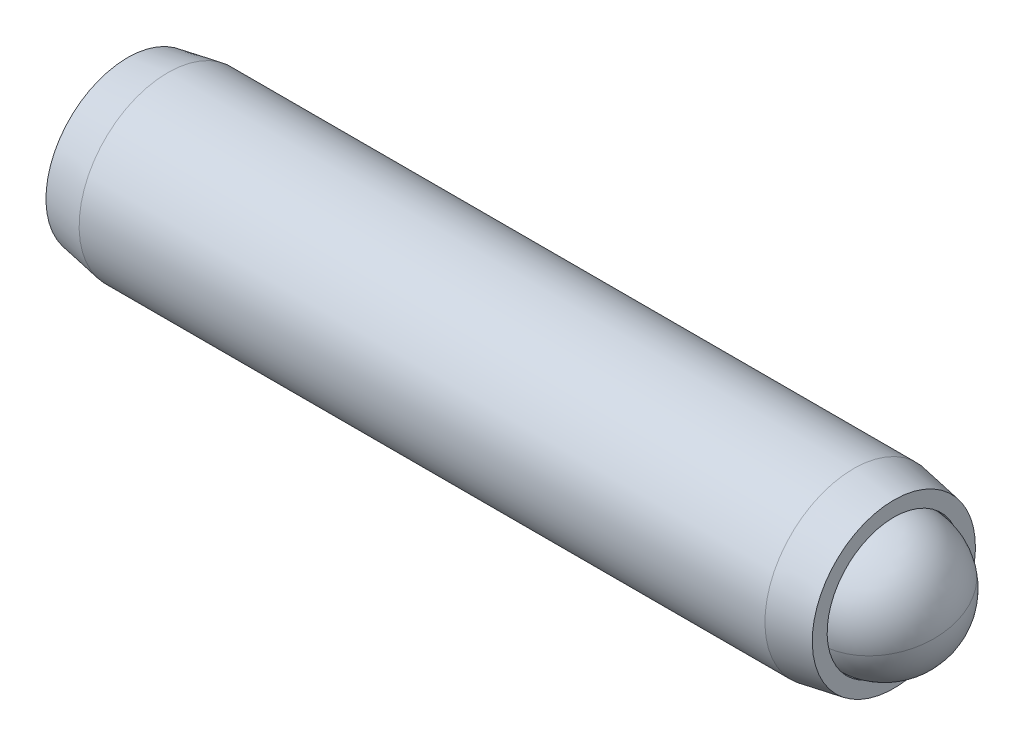
ISO-10303-21;
HEADER;
FILE_DESCRIPTION(('STEP AP214'),'2;1');
FILE_NAME('part.step','',(''),(''),'','','');
FILE_SCHEMA(('AUTOMOTIVE_DESIGN { 1 0 10303 214 1 1 1 1 }'));
ENDSEC;
DATA;
#1=APPLICATION_CONTEXT('core data for automotive mechanical design processes');
#2=APPLICATION_PROTOCOL_DEFINITION('international standard','automotive_design',2000,#1);
#3=PRODUCT_CONTEXT('',#1,'mechanical');
#4=PRODUCT('Part','Part','',(#3));
#5=PRODUCT_RELATED_PRODUCT_CATEGORY('part','',(#4));
#6=PRODUCT_DEFINITION_FORMATION('','',#4);
#7=PRODUCT_DEFINITION_CONTEXT('part definition',#1,'design');
#8=PRODUCT_DEFINITION('design','',#6,#7);
#9=PRODUCT_DEFINITION_SHAPE('','',#8);
#10=(LENGTH_UNIT() NAMED_UNIT(*) SI_UNIT(.MILLI.,.METRE.));
#11=(NAMED_UNIT(*) PLANE_ANGLE_UNIT() SI_UNIT($,.RADIAN.));
#12=(NAMED_UNIT(*) SI_UNIT($,.STERADIAN.) SOLID_ANGLE_UNIT());
#13=UNCERTAINTY_MEASURE_WITH_UNIT(LENGTH_MEASURE(1.E-05),#10,'distance_accuracy_value','');
#14=(GEOMETRIC_REPRESENTATION_CONTEXT(3) GLOBAL_UNCERTAINTY_ASSIGNED_CONTEXT((#13)) GLOBAL_UNIT_ASSIGNED_CONTEXT((#10,
#11,#12)) REPRESENTATION_CONTEXT('',''));
#15=CARTESIAN_POINT('',(0.,0.,0.));
#16=DIRECTION('',(0.,0.,1.));
#17=DIRECTION('',(1.,0.,0.));
#18=AXIS2_PLACEMENT_3D('',#15,#16,#17);
#19=CARTESIAN_POINT('',(-16.4333459470191,2.74204998828509,-0.965131231055238));
#20=DIRECTION('',(-1.,0.,0.));
#21=DIRECTION('',(0.,-1.,0.));
#22=AXIS2_PLACEMENT_3D('',#19,#20,#21);
#23=PLANE('',#22);
#24=DIRECTION('',(0.,0.866025403784439,-0.5));
#25=VECTOR('',#24,1.);
#26=CARTESIAN_POINT('',(-16.4333459470191,2.61504998828509,-2.33078112403965));
#27=LINE('',#26,#25);
#28=CARTESIAN_POINT('',(-16.4333459470191,1.49586248828509,-1.68461791964098));
#29=VERTEX_POINT('',#28);
#30=CARTESIAN_POINT('',(-16.4333459470191,2.74204998828509,-2.40410460822673));
#31=VERTEX_POINT('',#30);
#32=EDGE_CURVE('P0_E164',#29,#31,#27,.T.);
#33=ORIENTED_EDGE('',*,*,#32,.T.);
#34=DIRECTION('',(0.,0.866025403784439,0.5));
#35=VECTOR('',#34,1.);
#36=CARTESIAN_POINT('',(-16.4333459470191,3.86123748828509,-1.75794140382807));
#37=LINE('',#36,#35);
#38=CARTESIAN_POINT('',(-16.4333459470191,3.98823748828509,-1.68461791964098));
#39=VERTEX_POINT('',#38);
#40=EDGE_CURVE('P0_E166',#31,#39,#37,.T.);
#41=ORIENTED_EDGE('',*,*,#40,.T.);
#42=DIRECTION('',(0.,0.,1.));
#43=VECTOR('',#42,1.);
#44=CARTESIAN_POINT('',(-16.4333459470191,3.98823748828509,-0.392291510843657));
#45=LINE('',#44,#43);
#46=CARTESIAN_POINT('',(-16.4333459470191,3.98823748828509,-0.245644542469495));
#47=VERTEX_POINT('',#46);
#48=EDGE_CURVE('P0_E156',#39,#47,#45,.T.);
#49=ORIENTED_EDGE('',*,*,#48,.T.);
#50=DIRECTION('',(0.,-0.866025403784438,0.5));
#51=VECTOR('',#50,1.);
#52=CARTESIAN_POINT('',(-16.4333459470191,2.86904998828509,0.400518661929169));
#53=LINE('',#52,#51);
#54=CARTESIAN_POINT('',(-16.4333459470191,2.74204998828509,0.473842146116251));
#55=VERTEX_POINT('',#54);
#56=EDGE_CURVE('P0_E158',#47,#55,#53,.T.);
#57=ORIENTED_EDGE('',*,*,#56,.T.);
#58=DIRECTION('',(0.,-0.866025403784439,-0.5));
#59=VECTOR('',#58,1.);
#60=CARTESIAN_POINT('',(-16.4333459470191,1.62286248828509,-0.172321058282412));
#61=LINE('',#60,#59);
#62=CARTESIAN_POINT('',(-16.4333459470191,1.49586248828509,-0.245644542469493));
#63=VERTEX_POINT('',#62);
#64=EDGE_CURVE('P0_E160',#55,#63,#61,.T.);
#65=ORIENTED_EDGE('',*,*,#64,.T.);
#66=DIRECTION('',(0.,0.,-1.));
#67=VECTOR('',#66,1.);
#68=CARTESIAN_POINT('',(-16.4333459470191,1.49586248828509,-1.53797095126682));
#69=LINE('',#68,#67);
#70=EDGE_CURVE('P0_E162',#63,#29,#69,.T.);
#71=ORIENTED_EDGE('',*,*,#70,.T.);
#72=EDGE_LOOP('',(#33,#41,#49,#57,#65,#71));
#73=FACE_BOUND('',#72,.T.);
#74=CARTESIAN_POINT('',(-16.4333459470191,2.74204998828509,-0.965131231055238));
#75=DIRECTION('',(1.,0.,0.));
#76=DIRECTION('',(0.,1.,0.));
#77=AXIS2_PLACEMENT_3D('',#74,#75,#76);
#78=CIRCLE('',#77,2.921);
#79=CARTESIAN_POINT('',(-16.4333459470191,5.66304998828509,-0.965131231055238));
#80=VERTEX_POINT('',#79);
#81=EDGE_CURVE('P0_E150',#80,#80,#78,.T.);
#82=ORIENTED_EDGE('',*,*,#81,.F.);
#83=EDGE_LOOP('',(#82));
#84=FACE_BOUND('',#83,.T.);
#85=ADVANCED_FACE('P0_F17',(#73,#84),#23,.T.);
#86=CARTESIAN_POINT('',(-14.9928403648362,2.74204998828509,-0.965131231055238));
#87=DIRECTION('',(1.,0.,0.));
#88=DIRECTION('',(0.,1.,0.));
#89=AXIS2_PLACEMENT_3D('',#86,#87,#88);
#90=CONICAL_SURFACE('',#89,3.175,0.174532925199434);
#91=ORIENTED_EDGE('',*,*,#81,.T.);
#92=EDGE_LOOP('',(#91));
#93=FACE_BOUND('',#92,.T.);
#94=CARTESIAN_POINT('',(-14.9928403648362,2.74204998828509,-0.965131231055238));
#95=DIRECTION('',(1.,0.,0.));
#96=DIRECTION('',(0.,1.,0.));
#97=AXIS2_PLACEMENT_3D('',#94,#95,#96);
#98=CIRCLE('',#97,3.175);
#99=CARTESIAN_POINT('',(-14.9928403648362,5.91704998828509,-0.965131231055238));
#100=VERTEX_POINT('',#99);
#101=EDGE_CURVE('P0_E147',#100,#100,#98,.T.);
#102=ORIENTED_EDGE('',*,*,#101,.F.);
#103=EDGE_LOOP('',(#102));
#104=FACE_BOUND('',#103,.T.);
#105=ADVANCED_FACE('P0_F225',(#93,#104),#90,.T.);
#106=CARTESIAN_POINT('',(7.28180800757997,2.7420499882851,-0.965131231055238));
#107=DIRECTION('',(1.,0.,0.));
#108=DIRECTION('',(0.,1.,0.));
#109=AXIS2_PLACEMENT_3D('',#106,#107,#108);
#110=CYLINDRICAL_SURFACE('',#109,3.175);
#111=ORIENTED_EDGE('',*,*,#101,.T.);
#112=EDGE_LOOP('',(#111));
#113=FACE_BOUND('',#112,.T.);
#114=CARTESIAN_POINT('',(9.55814847079801,2.7420499882851,-0.965131231055238));
#115=DIRECTION('',(1.,0.,0.));
#116=DIRECTION('',(0.,1.,0.));
#117=AXIS2_PLACEMENT_3D('',#114,#115,#116);
#118=CIRCLE('',#117,3.175);
#119=CARTESIAN_POINT('',(9.55814847079801,5.91704998828509,-0.965131231055238));
#120=VERTEX_POINT('',#119);
#121=EDGE_CURVE('P0_E144',#120,#120,#118,.T.);
#122=ORIENTED_EDGE('',*,*,#121,.F.);
#123=EDGE_LOOP('',(#122));
#124=FACE_BOUND('',#123,.T.);
#125=ADVANCED_FACE('P0_F231',(#113,#124),#110,.T.);
#126=CARTESIAN_POINT('',(10.9986540529809,2.7420499882851,-0.965131231055238));
#127=DIRECTION('',(-1.,0.,0.));
#128=DIRECTION('',(0.,-1.,0.));
#129=AXIS2_PLACEMENT_3D('',#126,#127,#128);
#130=CONICAL_SURFACE('',#129,2.921,0.174532925199434);
#131=ORIENTED_EDGE('',*,*,#121,.T.);
#132=EDGE_LOOP('',(#131));
#133=FACE_BOUND('',#132,.T.);
#134=CARTESIAN_POINT('',(10.9986540529809,2.7420499882851,-0.965131231055238));
#135=DIRECTION('',(1.,0.,0.));
#136=DIRECTION('',(0.,1.,0.));
#137=AXIS2_PLACEMENT_3D('',#134,#135,#136);
#138=CIRCLE('',#137,2.921);
#139=CARTESIAN_POINT('',(10.9986540529809,5.66304998828509,-0.965131231055238));
#140=VERTEX_POINT('',#139);
#141=EDGE_CURVE('P0_E141',#140,#140,#138,.T.);
#142=ORIENTED_EDGE('',*,*,#141,.F.);
#143=EDGE_LOOP('',(#142));
#144=FACE_BOUND('',#143,.T.);
#145=ADVANCED_FACE('P0_F275',(#133,#144),#130,.T.);
#146=CARTESIAN_POINT('',(10.9986540529809,5.66304998828509,-0.965131231055238));
#147=DIRECTION('',(1.,0.,0.));
#148=DIRECTION('',(0.,1.,0.));
#149=AXIS2_PLACEMENT_3D('',#146,#147,#148);
#150=PLANE('',#149);
#151=ORIENTED_EDGE('',*,*,#141,.T.);
#152=EDGE_LOOP('',(#151));
#153=FACE_BOUND('',#152,.T.);
#154=CARTESIAN_POINT('',(10.9986540529809,2.7420499882851,-0.965131231055238));
#155=DIRECTION('',(1.,0.,0.));
#156=DIRECTION('',(0.,1.,0.));
#157=AXIS2_PLACEMENT_3D('',#154,#155,#156);
#158=CIRCLE('',#157,2.3876);
#159=CARTESIAN_POINT('',(10.9986540529809,5.1296499882851,-0.965131231055238));
#160=VERTEX_POINT('',#159);
#161=EDGE_CURVE('P0_E138',#160,#160,#158,.T.);
#162=ORIENTED_EDGE('',*,*,#161,.F.);
#163=EDGE_LOOP('',(#162));
#164=FACE_BOUND('',#163,.T.);
#165=ADVANCED_FACE('P0_F271',(#153,#164),#150,.T.);
#166=CARTESIAN_POINT('',(7.28180800757997,2.7420499882851,-0.965131231055238));
#167=DIRECTION('',(1.,0.,0.));
#168=DIRECTION('',(0.,1.,0.));
#169=AXIS2_PLACEMENT_3D('',#166,#167,#168);
#170=CYLINDRICAL_SURFACE('',#169,2.3876);
#171=ORIENTED_EDGE('',*,*,#161,.T.);
#172=EDGE_LOOP('',(#171));
#173=FACE_BOUND('',#172,.T.);
#174=CARTESIAN_POINT('',(9.66940800757996,2.7420499882851,-0.965131231055238));
#175=DIRECTION('',(1.,0.,0.));
#176=DIRECTION('',(0.,1.,0.));
#177=AXIS2_PLACEMENT_3D('',#174,#175,#176);
#178=CIRCLE('',#177,2.3876);
#179=CARTESIAN_POINT('',(9.66940800757996,5.1296499882851,-0.965131231055238));
#180=VERTEX_POINT('',#179);
#181=EDGE_CURVE('P0_E126',#180,#180,#178,.T.);
#182=ORIENTED_EDGE('',*,*,#181,.F.);
#183=EDGE_LOOP('',(#182));
#184=FACE_BOUND('',#183,.T.);
#185=ADVANCED_FACE('P0_F267',(#173,#184),#170,.F.);
#186=CARTESIAN_POINT('',(7.28180800757997,2.7420499882851,-0.965131231055238));
#187=DIRECTION('',(1.,0.,0.));
#188=DIRECTION('',(0.,1.,0.));
#189=AXIS2_PLACEMENT_3D('',#186,#187,#188);
#190=CONICAL_SURFACE('',#189,0.,0.78539816339745);
#191=ORIENTED_EDGE('',*,*,#181,.T.);
#192=EDGE_LOOP('',(#191));
#193=FACE_BOUND('',#192,.T.);
#194=CARTESIAN_POINT('',(7.28180800757997,2.7420499882851,-0.965131231055238));
#195=VERTEX_POINT('',#194);
#196=VERTEX_LOOP('',#195);
#197=FACE_BOUND('',#196,.T.);
#198=ADVANCED_FACE('P0_F221',(#193,#197),#190,.F.);
#199=CARTESIAN_POINT('',(-13.3853459470191,2.74204998828509,0.180548209367925));
#200=DIRECTION('',(0.,0.5,0.866025403784438));
#201=DIRECTION('',(0.,-0.866025403784438,0.5));
#202=AXIS2_PLACEMENT_3D('',#199,#200,#201);
#203=PLANE('',#202);
#204=DIRECTION('',(-1.,0.,0.));
#205=VECTOR('',#204,1.);
#206=CARTESIAN_POINT('',(-13.3853459470191,2.74204998828509,0.180548209367925));
#207=LINE('',#206,#205);
#208=CARTESIAN_POINT('',(-13.3853459470191,2.74204998828509,0.180548209367925));
#209=VERTEX_POINT('',#208);
#210=CARTESIAN_POINT('',(-16.1793459470191,2.74204998828509,0.180548209367925));
#211=VERTEX_POINT('',#210);
#212=EDGE_CURVE('P0_E124',#209,#211,#207,.T.);
#213=ORIENTED_EDGE('',*,*,#212,.T.);
#214=DIRECTION('',(0.,0.866025403784438,-0.5));
#215=VECTOR('',#214,1.);
#216=CARTESIAN_POINT('',(-16.1793459470191,3.73423748828509,-0.392291510843657));
#217=LINE('',#216,#215);
#218=CARTESIAN_POINT('',(-16.1793459470191,3.73423748828509,-0.392291510843657));
#219=VERTEX_POINT('',#218);
#220=EDGE_CURVE('P0_E26',#211,#219,#217,.T.);
#221=ORIENTED_EDGE('',*,*,#220,.T.);
#222=DIRECTION('',(-1.,0.,0.));
#223=VECTOR('',#222,1.);
#224=CARTESIAN_POINT('',(-13.3853459470191,3.73423748828509,-0.392291510843657));
#225=LINE('',#224,#223);
#226=CARTESIAN_POINT('',(-13.3853459470191,3.73423748828509,-0.392291510843657));
#227=VERTEX_POINT('',#226);
#228=EDGE_CURVE('P0_E90',#227,#219,#225,.T.);
#229=ORIENTED_EDGE('',*,*,#228,.F.);
#230=DIRECTION('',(0.,0.866025403784438,-0.5));
#231=VECTOR('',#230,1.);
#232=CARTESIAN_POINT('',(-13.3853459470191,2.74204998828509,0.180548209367925));
#233=LINE('',#232,#231);
#234=EDGE_CURVE('P0_E94',#209,#227,#233,.T.);
#235=ORIENTED_EDGE('',*,*,#234,.F.);
#236=EDGE_LOOP('',(#213,#221,#229,#235));
#237=FACE_BOUND('',#236,.T.);
#238=ADVANCED_FACE('P0_F92',(#237),#203,.F.);
#239=CARTESIAN_POINT('',(-13.3853459470191,1.74986248828509,-0.392291510843657));
#240=DIRECTION('',(0.,-0.499999999999999,0.866025403784439));
#241=DIRECTION('',(0.,-0.866025403784439,-0.5));
#242=AXIS2_PLACEMENT_3D('',#239,#240,#241);
#243=PLANE('',#242);
#244=DIRECTION('',(-1.,0.,0.));
#245=VECTOR('',#244,1.);
#246=CARTESIAN_POINT('',(-13.3853459470191,1.74986248828509,-0.392291510843657));
#247=LINE('',#246,#245);
#248=CARTESIAN_POINT('',(-13.3853459470191,1.74986248828509,-0.392291510843657));
#249=VERTEX_POINT('',#248);
#250=CARTESIAN_POINT('',(-16.1793459470191,1.74986248828509,-0.392291510843657));
#251=VERTEX_POINT('',#250);
#252=EDGE_CURVE('P0_E127',#249,#251,#247,.T.);
#253=ORIENTED_EDGE('',*,*,#252,.T.);
#254=DIRECTION('',(0.,0.866025403784439,0.5));
#255=VECTOR('',#254,1.);
#256=CARTESIAN_POINT('',(-16.1793459470191,2.74204998828509,0.180548209367925));
#257=LINE('',#256,#255);
#258=EDGE_CURVE('P0_E41',#251,#211,#257,.T.);
#259=ORIENTED_EDGE('',*,*,#258,.T.);
#260=ORIENTED_EDGE('',*,*,#212,.F.);
#261=DIRECTION('',(0.,0.866025403784439,0.499999999999999));
#262=VECTOR('',#261,1.);
#263=CARTESIAN_POINT('',(-13.3853459470191,1.74986248828509,-0.392291510843657));
#264=LINE('',#263,#262);
#265=EDGE_CURVE('P0_E99',#249,#209,#264,.T.);
#266=ORIENTED_EDGE('',*,*,#265,.F.);
#267=EDGE_LOOP('',(#253,#259,#260,#266));
#268=FACE_BOUND('',#267,.T.);
#269=ADVANCED_FACE('P0_F212',(#268),#243,.F.);
#270=CARTESIAN_POINT('',(-13.3853459470191,1.74986248828509,-1.53797095126682));
#271=DIRECTION('',(0.,-1.,0.));
#272=DIRECTION('',(0.,0.,-1.));
#273=AXIS2_PLACEMENT_3D('',#270,#271,#272);
#274=PLANE('',#273);
#275=DIRECTION('',(-1.,0.,0.));
#276=VECTOR('',#275,1.);
#277=CARTESIAN_POINT('',(-13.3853459470191,1.74986248828509,-1.53797095126682));
#278=LINE('',#277,#276);
#279=CARTESIAN_POINT('',(-13.3853459470191,1.74986248828509,-1.53797095126682));
#280=VERTEX_POINT('',#279);
#281=CARTESIAN_POINT('',(-16.1793459470191,1.74986248828509,-1.53797095126682));
#282=VERTEX_POINT('',#281);
#283=EDGE_CURVE('P0_E129',#280,#282,#278,.T.);
#284=ORIENTED_EDGE('',*,*,#283,.T.);
#285=DIRECTION('',(0.,0.,1.));
#286=VECTOR('',#285,1.);
#287=CARTESIAN_POINT('',(-16.1793459470191,1.74986248828509,-0.392291510843657));
#288=LINE('',#287,#286);
#289=EDGE_CURVE('P0_E171',#282,#251,#288,.T.);
#290=ORIENTED_EDGE('',*,*,#289,.T.);
#291=ORIENTED_EDGE('',*,*,#252,.F.);
#292=DIRECTION('',(0.,0.,1.));
#293=VECTOR('',#292,1.);
#294=CARTESIAN_POINT('',(-13.3853459470191,1.74986248828509,-1.53797095126682));
#295=LINE('',#294,#293);
#296=EDGE_CURVE('P0_E121',#280,#249,#295,.T.);
#297=ORIENTED_EDGE('',*,*,#296,.F.);
#298=EDGE_LOOP('',(#284,#290,#291,#297));
#299=FACE_BOUND('',#298,.T.);
#300=ADVANCED_FACE('P0_F211',(#299),#274,.F.);
#301=CARTESIAN_POINT('',(-13.3853459470191,2.74204998828509,-2.1108106714784));
#302=DIRECTION('',(0.,-0.5,-0.866025403784438));
#303=DIRECTION('',(0.,0.866025403784439,-0.5));
#304=AXIS2_PLACEMENT_3D('',#301,#302,#303);
#305=PLANE('',#304);
#306=DIRECTION('',(-1.,0.,0.));
#307=VECTOR('',#306,1.);
#308=CARTESIAN_POINT('',(-13.3853459470191,2.74204998828509,-2.1108106714784));
#309=LINE('',#308,#307);
#310=CARTESIAN_POINT('',(-13.3853459470191,2.74204998828509,-2.1108106714784));
#311=VERTEX_POINT('',#310);
#312=CARTESIAN_POINT('',(-16.1793459470191,2.74204998828509,-2.1108106714784));
#313=VERTEX_POINT('',#312);
#314=EDGE_CURVE('P0_E132',#311,#313,#309,.T.);
#315=ORIENTED_EDGE('',*,*,#314,.T.);
#316=DIRECTION('',(0.,-0.866025403784439,0.5));
#317=VECTOR('',#316,1.);
#318=CARTESIAN_POINT('',(-16.1793459470191,1.74986248828509,-1.53797095126682));
#319=LINE('',#318,#317);
#320=EDGE_CURVE('P0_E169',#313,#282,#319,.T.);
#321=ORIENTED_EDGE('',*,*,#320,.T.);
#322=ORIENTED_EDGE('',*,*,#283,.F.);
#323=DIRECTION('',(0.,-0.866025403784438,0.5));
#324=VECTOR('',#323,1.);
#325=CARTESIAN_POINT('',(-13.3853459470191,2.74204998828509,-2.1108106714784));
#326=LINE('',#325,#324);
#327=EDGE_CURVE('P0_E118',#311,#280,#326,.T.);
#328=ORIENTED_EDGE('',*,*,#327,.F.);
#329=EDGE_LOOP('',(#315,#321,#322,#328));
#330=FACE_BOUND('',#329,.T.);
#331=ADVANCED_FACE('P0_F208',(#330),#305,.F.);
#332=CARTESIAN_POINT('',(-13.3853459470191,3.73423748828509,-1.53797095126682));
#333=DIRECTION('',(0.,0.5,-0.866025403784439));
#334=DIRECTION('',(0.,0.866025403784439,0.5));
#335=AXIS2_PLACEMENT_3D('',#332,#333,#334);
#336=PLANE('',#335);
#337=DIRECTION('',(-1.,0.,0.));
#338=VECTOR('',#337,1.);
#339=CARTESIAN_POINT('',(-13.3853459470191,3.73423748828509,-1.53797095126682));
#340=LINE('',#339,#338);
#341=CARTESIAN_POINT('',(-13.3853459470191,3.73423748828509,-1.53797095126682));
#342=VERTEX_POINT('',#341);
#343=CARTESIAN_POINT('',(-16.1793459470191,3.73423748828509,-1.53797095126682));
#344=VERTEX_POINT('',#343);
#345=EDGE_CURVE('P0_E98',#342,#344,#340,.T.);
#346=ORIENTED_EDGE('',*,*,#345,.T.);
#347=DIRECTION('',(0.,-0.866025403784439,-0.5));
#348=VECTOR('',#347,1.);
#349=CARTESIAN_POINT('',(-16.1793459470191,2.74204998828509,-2.1108106714784));
#350=LINE('',#349,#348);
#351=EDGE_CURVE('P0_E153',#344,#313,#350,.T.);
#352=ORIENTED_EDGE('',*,*,#351,.T.);
#353=ORIENTED_EDGE('',*,*,#314,.F.);
#354=DIRECTION('',(0.,-0.866025403784439,-0.5));
#355=VECTOR('',#354,1.);
#356=CARTESIAN_POINT('',(-13.3853459470191,3.73423748828509,-1.53797095126682));
#357=LINE('',#356,#355);
#358=EDGE_CURVE('P0_E108',#342,#311,#357,.T.);
#359=ORIENTED_EDGE('',*,*,#358,.F.);
#360=EDGE_LOOP('',(#346,#352,#353,#359));
#361=FACE_BOUND('',#360,.T.);
#362=ADVANCED_FACE('P0_F204',(#361),#336,.F.);
#363=CARTESIAN_POINT('',(-13.3853459470191,3.73423748828509,-0.392291510843657));
#364=DIRECTION('',(0.,1.,0.));
#365=DIRECTION('',(-1.,0.,0.));
#366=AXIS2_PLACEMENT_3D('',#363,#364,#365);
#367=PLANE('',#366);
#368=ORIENTED_EDGE('',*,*,#228,.T.);
#369=DIRECTION('',(0.,0.,-1.));
#370=VECTOR('',#369,1.);
#371=CARTESIAN_POINT('',(-16.1793459470191,3.73423748828509,-1.53797095126682));
#372=LINE('',#371,#370);
#373=EDGE_CURVE('P0_E11',#219,#344,#372,.T.);
#374=ORIENTED_EDGE('',*,*,#373,.T.);
#375=ORIENTED_EDGE('',*,*,#345,.F.);
#376=DIRECTION('',(0.,0.,-1.));
#377=VECTOR('',#376,1.);
#378=CARTESIAN_POINT('',(-13.3853459470191,3.73423748828509,-0.392291510843657));
#379=LINE('',#378,#377);
#380=EDGE_CURVE('P0_E102',#227,#342,#379,.T.);
#381=ORIENTED_EDGE('',*,*,#380,.F.);
#382=EDGE_LOOP('',(#368,#374,#375,#381));
#383=FACE_BOUND('',#382,.T.);
#384=ADVANCED_FACE('P0_F103',(#383),#367,.F.);
#385=CARTESIAN_POINT('',(-13.3853459470191,4.72642498828509,-0.96513123105524));
#386=DIRECTION('',(-1.,0.,0.));
#387=DIRECTION('',(0.,0.,1.));
#388=AXIS2_PLACEMENT_3D('',#385,#386,#387);
#389=PLANE('',#388);
#390=ORIENTED_EDGE('',*,*,#234,.T.);
#391=ORIENTED_EDGE('',*,*,#380,.T.);
#392=ORIENTED_EDGE('',*,*,#358,.T.);
#393=ORIENTED_EDGE('',*,*,#327,.T.);
#394=ORIENTED_EDGE('',*,*,#296,.T.);
#395=ORIENTED_EDGE('',*,*,#265,.T.);
#396=EDGE_LOOP('',(#390,#391,#392,#393,#394,#395));
#397=FACE_BOUND('',#396,.T.);
#398=ADVANCED_FACE('P0_F110',(#397),#389,.T.);
#399=CARTESIAN_POINT('',(-16.1793459470191,1.74986248828509,-0.392291510843657));
#400=DIRECTION('',(-0.707106781186548,0.353553390593273,-0.612372435695795));
#401=DIRECTION('',(-0.654653670707977,0.,0.755928946018454));
#402=AXIS2_PLACEMENT_3D('',#399,#400,#401);
#403=PLANE('',#402);
#404=DIRECTION('',(-0.654653670707977,-0.654653670707977,0.377964473009228));
#405=VECTOR('',#404,1.);
#406=CARTESIAN_POINT('',(-15.895863804162,2.03334463114223,-0.55596000233268));
#407=LINE('',#406,#405);
#408=EDGE_CURVE('P0_E115',#63,#251,#407,.F.);
#409=ORIENTED_EDGE('',*,*,#408,.F.);
#410=ORIENTED_EDGE('',*,*,#64,.F.);
#411=DIRECTION('',(-0.654653670707977,0.,0.755928946018454));
#412=VECTOR('',#411,1.);
#413=CARTESIAN_POINT('',(-15.895863804162,2.74204998828509,-0.146788773610121));
#414=LINE('',#413,#412);
#415=EDGE_CURVE('P0_E21',#211,#55,#414,.T.);
#416=ORIENTED_EDGE('',*,*,#415,.F.);
#417=ORIENTED_EDGE('',*,*,#258,.F.);
#418=EDGE_LOOP('',(#409,#410,#416,#417));
#419=FACE_BOUND('',#418,.T.);
#420=ADVANCED_FACE('P0_F19',(#419),#403,.T.);
#421=CARTESIAN_POINT('',(-16.1793459470191,2.74204998828509,0.180548209367925));
#422=DIRECTION('',(-0.707106781186547,-0.353553390593274,-0.612372435695795));
#423=DIRECTION('',(-0.654653670707978,0.,0.755928946018454));
#424=AXIS2_PLACEMENT_3D('',#421,#422,#423);
#425=PLANE('',#424);
#426=ORIENTED_EDGE('',*,*,#415,.T.);
#427=ORIENTED_EDGE('',*,*,#56,.F.);
#428=DIRECTION('',(-0.654653670707977,0.654653670707977,0.377964473009226));
#429=VECTOR('',#428,1.);
#430=CARTESIAN_POINT('',(-15.895863804162,3.45075534542795,-0.555960002332681));
#431=LINE('',#430,#429);
#432=EDGE_CURVE('P0_E182',#219,#47,#431,.T.);
#433=ORIENTED_EDGE('',*,*,#432,.F.);
#434=ORIENTED_EDGE('',*,*,#220,.F.);
#435=EDGE_LOOP('',(#426,#427,#433,#434));
#436=FACE_BOUND('',#435,.T.);
#437=ADVANCED_FACE('P0_F196',(#436),#425,.T.);
#438=CARTESIAN_POINT('',(-16.1793459470191,1.74986248828509,-1.53797095126682));
#439=DIRECTION('',(-0.707106781186548,0.707106781186547,0.));
#440=DIRECTION('',(-0.707106781186547,-0.707106781186548,0.));
#441=AXIS2_PLACEMENT_3D('',#438,#439,#440);
#442=PLANE('',#441);
#443=ORIENTED_EDGE('',*,*,#408,.T.);
#444=ORIENTED_EDGE('',*,*,#289,.F.);
#445=DIRECTION('',(-0.654653670707977,-0.654653670707978,-0.377964473009226));
#446=VECTOR('',#445,1.);
#447=CARTESIAN_POINT('',(-15.895863804162,2.03334463114223,-1.3743024597778));
#448=LINE('',#447,#446);
#449=EDGE_CURVE('P0_E179',#29,#282,#448,.F.);
#450=ORIENTED_EDGE('',*,*,#449,.F.);
#451=ORIENTED_EDGE('',*,*,#70,.F.);
#452=EDGE_LOOP('',(#443,#444,#450,#451));
#453=FACE_BOUND('',#452,.T.);
#454=ADVANCED_FACE('P0_F189',(#453),#442,.T.);
#455=CARTESIAN_POINT('',(-16.1793459470191,3.73423748828509,-0.392291510843657));
#456=DIRECTION('',(-0.707106781186548,-0.707106781186548,0.));
#457=DIRECTION('',(0.707106781186548,-0.707106781186548,0.));
#458=AXIS2_PLACEMENT_3D('',#455,#456,#457);
#459=PLANE('',#458);
#460=ORIENTED_EDGE('',*,*,#432,.T.);
#461=ORIENTED_EDGE('',*,*,#48,.F.);
#462=DIRECTION('',(0.654653670707977,-0.654653670707977,0.377964473009227));
#463=VECTOR('',#462,1.);
#464=CARTESIAN_POINT('',(-16.1793459470191,3.73423748828509,-1.53797095126682));
#465=LINE('',#464,#463);
#466=EDGE_CURVE('P0_E177',#344,#39,#465,.F.);
#467=ORIENTED_EDGE('',*,*,#466,.F.);
#468=ORIENTED_EDGE('',*,*,#373,.F.);
#469=EDGE_LOOP('',(#460,#461,#467,#468));
#470=FACE_BOUND('',#469,.T.);
#471=ADVANCED_FACE('P0_F201',(#470),#459,.T.);
#472=CARTESIAN_POINT('',(-16.1793459470191,2.74204998828509,-2.1108106714784));
#473=DIRECTION('',(-0.707106781186547,0.353553390593274,0.612372435695795));
#474=DIRECTION('',(0.654653670707978,0.,0.755928946018454));
#475=AXIS2_PLACEMENT_3D('',#472,#473,#474);
#476=PLANE('',#475);
#477=ORIENTED_EDGE('',*,*,#449,.T.);
#478=ORIENTED_EDGE('',*,*,#320,.F.);
#479=DIRECTION('',(-0.654653670707978,0.,-0.755928946018454));
#480=VECTOR('',#479,1.);
#481=CARTESIAN_POINT('',(-15.895863804162,2.74204998828509,-1.78347368850036));
#482=LINE('',#481,#480);
#483=EDGE_CURVE('P0_E175',#31,#313,#482,.F.);
#484=ORIENTED_EDGE('',*,*,#483,.F.);
#485=ORIENTED_EDGE('',*,*,#32,.F.);
#486=EDGE_LOOP('',(#477,#478,#484,#485));
#487=FACE_BOUND('',#486,.T.);
#488=ADVANCED_FACE('P0_F240',(#487),#476,.T.);
#489=CARTESIAN_POINT('',(-16.1793459470191,3.73423748828509,-1.53797095126682));
#490=DIRECTION('',(-0.707106781186547,-0.353553390593274,0.612372435695795));
#491=DIRECTION('',(0.654653670707977,0.,0.755928946018454));
#492=AXIS2_PLACEMENT_3D('',#489,#490,#491);
#493=PLANE('',#492);
#494=ORIENTED_EDGE('',*,*,#466,.T.);
#495=ORIENTED_EDGE('',*,*,#40,.F.);
#496=ORIENTED_EDGE('',*,*,#483,.T.);
#497=ORIENTED_EDGE('',*,*,#351,.F.);
#498=EDGE_LOOP('',(#494,#495,#496,#497));
#499=FACE_BOUND('',#498,.T.);
#500=ADVANCED_FACE('P0_F237',(#499),#493,.T.);
#501=CLOSED_SHELL('',(#85,#105,#125,#145,#165,#185,#198,#238,#269,#300,#331,#362,#384,#398,#420,
#437,#454,#471,#488,#500));
#502=MANIFOLD_SOLID_BREP('P0_B1',#501);
#503=CARTESIAN_POINT('',(10.6494040529809,2.7420499882851,-0.965131231055239));
#504=DIRECTION('',(0.,0.972214232741158,0.234092899626454));
#505=DIRECTION('',(0.,0.234092899626454,-0.972214232741158));
#506=AXIS2_PLACEMENT_3D('',#503,#504,#505);
#507=SPHERICAL_SURFACE('',#506,2.38125);
#508=CARTESIAN_POINT('',(10.6494040529809,2.7420499882851,-0.965131231055239));
#509=DIRECTION('',(1.,0.,0.));
#510=DIRECTION('',(0.,0.234092899626454,-0.972214232741158));
#511=AXIS2_PLACEMENT_3D('',#508,#509,#510);
#512=CIRCLE('',#511,2.38125);
#513=CARTESIAN_POINT('',(10.6494040529809,3.29948370552059,-3.28021637277012));
#514=VERTEX_POINT('',#513);
#515=CARTESIAN_POINT('',(10.6494040529809,2.1846162710496,1.34995391065964));
#516=VERTEX_POINT('',#515);
#517=EDGE_CURVE('P1_E33',#514,#516,#512,.T.);
#518=ORIENTED_EDGE('',*,*,#517,.T.);
#519=CARTESIAN_POINT('',(10.6494040529809,2.7420499882851,-0.965131231055239));
#520=DIRECTION('',(0.,0.972214232741158,0.234092899626454));
#521=DIRECTION('',(1.,0.,0.));
#522=AXIS2_PLACEMENT_3D('',#519,#520,#521);
#523=CIRCLE('',#522,2.38125);
#524=EDGE_CURVE('P1_E10',#516,#514,#523,.T.);
#525=ORIENTED_EDGE('',*,*,#524,.T.);
#526=EDGE_LOOP('',(#518,#525));
#527=FACE_BOUND('',#526,.T.);
#528=ADVANCED_FACE('P1_F16',(#527),#507,.T.);
#529=ORIENTED_EDGE('',*,*,#517,.F.);
#530=CARTESIAN_POINT('',(10.6494040529809,2.7420499882851,-0.965131231055239));
#531=DIRECTION('',(0.,0.972214232741158,0.234092899626454));
#532=DIRECTION('',(1.,0.,0.));
#533=AXIS2_PLACEMENT_3D('',#530,#531,#532);
#534=CIRCLE('',#533,2.38125);
#535=EDGE_CURVE('P1_E23',#514,#516,#534,.T.);
#536=ORIENTED_EDGE('',*,*,#535,.T.);
#537=EDGE_LOOP('',(#529,#536));
#538=FACE_BOUND('',#537,.T.);
#539=ADVANCED_FACE('P1_F40',(#538),#507,.T.);
#540=ORIENTED_EDGE('',*,*,#524,.F.);
#541=EDGE_CURVE('P1_E36',#516,#514,#512,.T.);
#542=ORIENTED_EDGE('',*,*,#541,.T.);
#543=EDGE_LOOP('',(#540,#542));
#544=FACE_BOUND('',#543,.T.);
#545=ADVANCED_FACE('P1_F38',(#544),#507,.T.);
#546=ORIENTED_EDGE('',*,*,#535,.F.);
#547=ORIENTED_EDGE('',*,*,#541,.F.);
#548=EDGE_LOOP('',(#546,#547));
#549=FACE_BOUND('',#548,.T.);
#550=ADVANCED_FACE('P1_F18',(#549),#507,.T.);
#551=CLOSED_SHELL('',(#528,#539,#545,#550));
#552=MANIFOLD_SOLID_BREP('P1_B1',#551);
#553=ADVANCED_BREP_SHAPE_REPRESENTATION('',(#18,#502,#552),#14);
#554=SHAPE_DEFINITION_REPRESENTATION(#9,#553);
ENDSEC;
END-ISO-10303-21;
